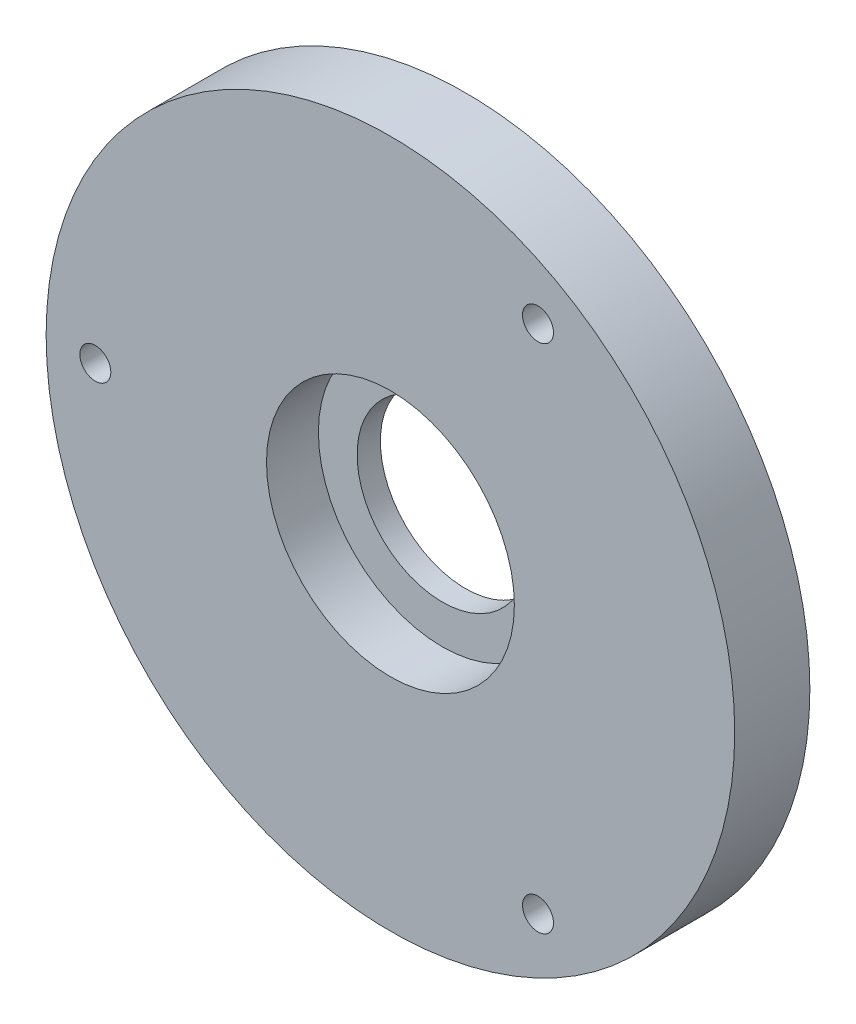
ISO-10303-21;
HEADER;
FILE_DESCRIPTION(('STEP AP214'),'2;1');
FILE_NAME('part.step','',(''),(''),'','','');
FILE_SCHEMA(('AUTOMOTIVE_DESIGN { 1 0 10303 214 1 1 1 1 }'));
ENDSEC;
DATA;
#1=APPLICATION_CONTEXT('core data for automotive mechanical design processes');
#2=APPLICATION_PROTOCOL_DEFINITION('international standard','automotive_design',2000,#1);
#3=PRODUCT_CONTEXT('',#1,'mechanical');
#4=PRODUCT('Part','Part','',(#3));
#5=PRODUCT_RELATED_PRODUCT_CATEGORY('part','',(#4));
#6=PRODUCT_DEFINITION_FORMATION('','',#4);
#7=PRODUCT_DEFINITION_CONTEXT('part definition',#1,'design');
#8=PRODUCT_DEFINITION('design','',#6,#7);
#9=PRODUCT_DEFINITION_SHAPE('','',#8);
#10=(LENGTH_UNIT() NAMED_UNIT(*) SI_UNIT(.MILLI.,.METRE.));
#11=(NAMED_UNIT(*) PLANE_ANGLE_UNIT() SI_UNIT($,.RADIAN.));
#12=(NAMED_UNIT(*) SI_UNIT($,.STERADIAN.) SOLID_ANGLE_UNIT());
#13=UNCERTAINTY_MEASURE_WITH_UNIT(LENGTH_MEASURE(1.E-05),#10,'distance_accuracy_value','');
#14=(GEOMETRIC_REPRESENTATION_CONTEXT(3) GLOBAL_UNCERTAINTY_ASSIGNED_CONTEXT((#13)) GLOBAL_UNIT_ASSIGNED_CONTEXT((#10,
#11,#12)) REPRESENTATION_CONTEXT('',''));
#15=CARTESIAN_POINT('',(0.,0.,0.));
#16=DIRECTION('',(0.,0.,1.));
#17=DIRECTION('',(1.,0.,0.));
#18=AXIS2_PLACEMENT_3D('',#15,#16,#17);
#19=CARTESIAN_POINT('',(0.,0.,9.7));
#20=DIRECTION('',(0.,0.,-1.));
#21=DIRECTION('',(-1.,0.,0.));
#22=AXIS2_PLACEMENT_3D('',#19,#20,#21);
#23=CYLINDRICAL_SURFACE('',#22,44.45);
#24=CARTESIAN_POINT('',(0.,0.,9.7));
#25=DIRECTION('',(0.,0.,1.));
#26=DIRECTION('',(1.,0.,0.));
#27=AXIS2_PLACEMENT_3D('',#24,#25,#26);
#28=CIRCLE('',#27,44.45);
#29=CARTESIAN_POINT('',(44.45,0.,9.7));
#30=VERTEX_POINT('',#29);
#31=EDGE_CURVE('E11',#30,#30,#28,.T.);
#32=ORIENTED_EDGE('',*,*,#31,.F.);
#33=EDGE_LOOP('',(#32));
#34=FACE_BOUND('',#33,.T.);
#35=CARTESIAN_POINT('',(0.,0.,0.));
#36=DIRECTION('',(0.,0.,1.));
#37=DIRECTION('',(1.,0.,0.));
#38=AXIS2_PLACEMENT_3D('',#35,#36,#37);
#39=CIRCLE('',#38,44.45);
#40=CARTESIAN_POINT('',(44.45,0.,0.));
#41=VERTEX_POINT('',#40);
#42=EDGE_CURVE('E36',#41,#41,#39,.T.);
#43=ORIENTED_EDGE('',*,*,#42,.T.);
#44=EDGE_LOOP('',(#43));
#45=FACE_BOUND('',#44,.T.);
#46=ADVANCED_FACE('F33',(#34,#45),#23,.T.);
#47=CARTESIAN_POINT('',(0.,0.,9.7));
#48=DIRECTION('',(0.,0.,1.));
#49=DIRECTION('',(1.,0.,0.));
#50=AXIS2_PLACEMENT_3D('',#47,#48,#49);
#51=PLANE('',#50);
#52=CARTESIAN_POINT('',(19.0499999999999,32.9955678841872,9.7));
#53=DIRECTION('',(0.,0.,-1.));
#54=DIRECTION('',(-1.,0.,0.));
#55=AXIS2_PLACEMENT_3D('',#52,#53,#54);
#56=CIRCLE('',#55,2.);
#57=CARTESIAN_POINT('',(17.0499999999999,32.9955678841872,9.7));
#58=VERTEX_POINT('',#57);
#59=EDGE_CURVE('E66',#58,#58,#56,.T.);
#60=ORIENTED_EDGE('',*,*,#59,.T.);
#61=EDGE_LOOP('',(#60));
#62=FACE_BOUND('',#61,.T.);
#63=CARTESIAN_POINT('',(19.0500000000001,-32.9955678841871,9.7));
#64=DIRECTION('',(0.,0.,-1.));
#65=DIRECTION('',(-1.,0.,0.));
#66=AXIS2_PLACEMENT_3D('',#63,#64,#65);
#67=CIRCLE('',#66,1.99999999999995);
#68=CARTESIAN_POINT('',(17.0500000000001,-32.9955678841871,9.7));
#69=VERTEX_POINT('',#68);
#70=EDGE_CURVE('E60',#69,#69,#67,.T.);
#71=ORIENTED_EDGE('',*,*,#70,.T.);
#72=EDGE_LOOP('',(#71));
#73=FACE_BOUND('',#72,.T.);
#74=CARTESIAN_POINT('',(-38.1,0.,9.7));
#75=DIRECTION('',(0.,0.,-1.));
#76=DIRECTION('',(-1.,0.,0.));
#77=AXIS2_PLACEMENT_3D('',#74,#75,#76);
#78=CIRCLE('',#77,2.);
#79=CARTESIAN_POINT('',(-40.1,0.,9.7));
#80=VERTEX_POINT('',#79);
#81=EDGE_CURVE('E56',#80,#80,#78,.T.);
#82=ORIENTED_EDGE('',*,*,#81,.T.);
#83=EDGE_LOOP('',(#82));
#84=FACE_BOUND('',#83,.T.);
#85=CARTESIAN_POINT('',(0.,0.,9.7));
#86=DIRECTION('',(0.,0.,1.));
#87=DIRECTION('',(1.,0.,0.));
#88=AXIS2_PLACEMENT_3D('',#85,#86,#87);
#89=CIRCLE('',#88,16.);
#90=CARTESIAN_POINT('',(16.,0.,9.7));
#91=VERTEX_POINT('',#90);
#92=EDGE_CURVE('E47',#91,#91,#89,.T.);
#93=ORIENTED_EDGE('',*,*,#92,.F.);
#94=EDGE_LOOP('',(#93));
#95=FACE_BOUND('',#94,.T.);
#96=ORIENTED_EDGE('',*,*,#31,.T.);
#97=EDGE_LOOP('',(#96));
#98=FACE_BOUND('',#97,.T.);
#99=ADVANCED_FACE('F75',(#62,#73,#84,#95,#98),#51,.T.);
#100=CARTESIAN_POINT('',(0.,0.,0.));
#101=DIRECTION('',(0.,0.,1.));
#102=DIRECTION('',(1.,0.,0.));
#103=AXIS2_PLACEMENT_3D('',#100,#101,#102);
#104=PLANE('',#103);
#105=CARTESIAN_POINT('',(19.0499999999999,32.9955678841872,0.));
#106=DIRECTION('',(0.,0.,-1.));
#107=DIRECTION('',(-1.,0.,0.));
#108=AXIS2_PLACEMENT_3D('',#105,#106,#107);
#109=CIRCLE('',#108,2.);
#110=CARTESIAN_POINT('',(17.0499999999999,32.9955678841872,0.));
#111=VERTEX_POINT('',#110);
#112=EDGE_CURVE('E69',#111,#111,#109,.T.);
#113=ORIENTED_EDGE('',*,*,#112,.F.);
#114=EDGE_LOOP('',(#113));
#115=FACE_BOUND('',#114,.T.);
#116=CARTESIAN_POINT('',(19.0500000000001,-32.9955678841871,0.));
#117=DIRECTION('',(0.,0.,-1.));
#118=DIRECTION('',(-1.,0.,0.));
#119=AXIS2_PLACEMENT_3D('',#116,#117,#118);
#120=CIRCLE('',#119,1.99999999999995);
#121=CARTESIAN_POINT('',(17.0500000000001,-32.9955678841871,0.));
#122=VERTEX_POINT('',#121);
#123=EDGE_CURVE('E63',#122,#122,#120,.T.);
#124=ORIENTED_EDGE('',*,*,#123,.F.);
#125=EDGE_LOOP('',(#124));
#126=FACE_BOUND('',#125,.T.);
#127=CARTESIAN_POINT('',(-38.1,0.,0.));
#128=DIRECTION('',(0.,0.,-1.));
#129=DIRECTION('',(-1.,0.,0.));
#130=AXIS2_PLACEMENT_3D('',#127,#128,#129);
#131=CIRCLE('',#130,2.);
#132=CARTESIAN_POINT('',(-40.1,0.,0.));
#133=VERTEX_POINT('',#132);
#134=EDGE_CURVE('E57',#133,#133,#131,.T.);
#135=ORIENTED_EDGE('',*,*,#134,.F.);
#136=EDGE_LOOP('',(#135));
#137=FACE_BOUND('',#136,.T.);
#138=CARTESIAN_POINT('',(0.,0.,0.));
#139=DIRECTION('',(0.,0.,1.));
#140=DIRECTION('',(1.,0.,0.));
#141=AXIS2_PLACEMENT_3D('',#138,#139,#140);
#142=CIRCLE('',#141,11.);
#143=CARTESIAN_POINT('',(11.,0.,0.));
#144=VERTEX_POINT('',#143);
#145=EDGE_CURVE('E50',#144,#144,#142,.T.);
#146=ORIENTED_EDGE('',*,*,#145,.T.);
#147=EDGE_LOOP('',(#146));
#148=FACE_BOUND('',#147,.T.);
#149=ORIENTED_EDGE('',*,*,#42,.F.);
#150=EDGE_LOOP('',(#149));
#151=FACE_BOUND('',#150,.T.);
#152=ADVANCED_FACE('F85',(#115,#126,#137,#148,#151),#104,.F.);
#153=CARTESIAN_POINT('',(0.,0.,-45.254833995939));
#154=DIRECTION('',(0.,0.,1.));
#155=DIRECTION('',(1.,0.,0.));
#156=AXIS2_PLACEMENT_3D('',#153,#154,#155);
#157=CYLINDRICAL_SURFACE('',#156,16.);
#158=CARTESIAN_POINT('',(0.,0.,3.));
#159=DIRECTION('',(0.,0.,1.));
#160=DIRECTION('',(1.,0.,0.));
#161=AXIS2_PLACEMENT_3D('',#158,#159,#160);
#162=CIRCLE('',#161,16.);
#163=CARTESIAN_POINT('',(16.,0.,3.));
#164=VERTEX_POINT('',#163);
#165=EDGE_CURVE('E43',#164,#164,#162,.F.);
#166=ORIENTED_EDGE('',*,*,#165,.T.);
#167=EDGE_LOOP('',(#166));
#168=FACE_BOUND('',#167,.T.);
#169=ORIENTED_EDGE('',*,*,#92,.T.);
#170=EDGE_LOOP('',(#169));
#171=FACE_BOUND('',#170,.T.);
#172=ADVANCED_FACE('F88',(#168,#171),#157,.F.);
#173=CARTESIAN_POINT('',(0.,0.,3.));
#174=DIRECTION('',(0.,0.,1.));
#175=DIRECTION('',(1.,0.,0.));
#176=AXIS2_PLACEMENT_3D('',#173,#174,#175);
#177=PLANE('',#176);
#178=CARTESIAN_POINT('',(0.,0.,3.));
#179=DIRECTION('',(0.,0.,1.));
#180=DIRECTION('',(1.,0.,0.));
#181=AXIS2_PLACEMENT_3D('',#178,#179,#180);
#182=CIRCLE('',#181,11.);
#183=CARTESIAN_POINT('',(11.,0.,3.));
#184=VERTEX_POINT('',#183);
#185=EDGE_CURVE('E53',#184,#184,#182,.T.);
#186=ORIENTED_EDGE('',*,*,#185,.F.);
#187=EDGE_LOOP('',(#186));
#188=FACE_BOUND('',#187,.T.);
#189=ORIENTED_EDGE('',*,*,#165,.F.);
#190=EDGE_LOOP('',(#189));
#191=FACE_BOUND('',#190,.T.);
#192=ADVANCED_FACE('F108',(#188,#191),#177,.T.);
#193=CARTESIAN_POINT('',(0.,0.,-6.));
#194=DIRECTION('',(0.,0.,1.));
#195=DIRECTION('',(1.,0.,0.));
#196=AXIS2_PLACEMENT_3D('',#193,#194,#195);
#197=CYLINDRICAL_SURFACE('',#196,11.);
#198=ORIENTED_EDGE('',*,*,#185,.T.);
#199=EDGE_LOOP('',(#198));
#200=FACE_BOUND('',#199,.T.);
#201=ORIENTED_EDGE('',*,*,#145,.F.);
#202=EDGE_LOOP('',(#201));
#203=FACE_BOUND('',#202,.T.);
#204=ADVANCED_FACE('F112',(#200,#203),#197,.F.);
#205=CARTESIAN_POINT('',(-38.1,0.,9.7));
#206=DIRECTION('',(0.,0.,-1.));
#207=DIRECTION('',(-1.,0.,0.));
#208=AXIS2_PLACEMENT_3D('',#205,#206,#207);
#209=CYLINDRICAL_SURFACE('',#208,2.);
#210=ORIENTED_EDGE('',*,*,#81,.F.);
#211=EDGE_LOOP('',(#210));
#212=FACE_BOUND('',#211,.T.);
#213=ORIENTED_EDGE('',*,*,#134,.T.);
#214=EDGE_LOOP('',(#213));
#215=FACE_BOUND('',#214,.T.);
#216=ADVANCED_FACE('F116',(#212,#215),#209,.F.);
#217=CARTESIAN_POINT('',(19.0500000000001,-32.9955678841871,9.7));
#218=DIRECTION('',(0.,0.,-1.));
#219=DIRECTION('',(-1.,0.,0.));
#220=AXIS2_PLACEMENT_3D('',#217,#218,#219);
#221=CYLINDRICAL_SURFACE('',#220,1.99999999999995);
#222=ORIENTED_EDGE('',*,*,#70,.F.);
#223=EDGE_LOOP('',(#222));
#224=FACE_BOUND('',#223,.T.);
#225=ORIENTED_EDGE('',*,*,#123,.T.);
#226=EDGE_LOOP('',(#225));
#227=FACE_BOUND('',#226,.T.);
#228=ADVANCED_FACE('F81',(#224,#227),#221,.F.);
#229=CARTESIAN_POINT('',(19.0499999999999,32.9955678841872,9.7));
#230=DIRECTION('',(0.,0.,-1.));
#231=DIRECTION('',(-1.,0.,0.));
#232=AXIS2_PLACEMENT_3D('',#229,#230,#231);
#233=CYLINDRICAL_SURFACE('',#232,2.);
#234=ORIENTED_EDGE('',*,*,#59,.F.);
#235=EDGE_LOOP('',(#234));
#236=FACE_BOUND('',#235,.T.);
#237=ORIENTED_EDGE('',*,*,#112,.T.);
#238=EDGE_LOOP('',(#237));
#239=FACE_BOUND('',#238,.T.);
#240=ADVANCED_FACE('F78',(#236,#239),#233,.F.);
#241=CLOSED_SHELL('',(#46,#99,#152,#172,#192,#204,#216,#228,#240));
#242=MANIFOLD_SOLID_BREP('B2',#241);
#243=ADVANCED_BREP_SHAPE_REPRESENTATION('',(#18,#242),#14);
#244=SHAPE_DEFINITION_REPRESENTATION(#9,#243);
ENDSEC;
END-ISO-10303-21;
